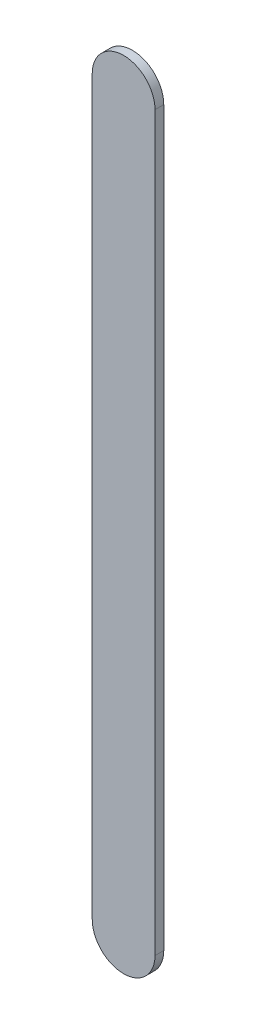
ISO-10303-21;
HEADER;
FILE_DESCRIPTION(('STEP AP214'),'2;1');
FILE_NAME('part.step','',(''),(''),'','','');
FILE_SCHEMA(('AUTOMOTIVE_DESIGN { 1 0 10303 214 1 1 1 1 }'));
ENDSEC;
DATA;
#1=APPLICATION_CONTEXT('core data for automotive mechanical design processes');
#2=APPLICATION_PROTOCOL_DEFINITION('international standard','automotive_design',2000,#1);
#3=PRODUCT_CONTEXT('',#1,'mechanical');
#4=PRODUCT('Part','Part','',(#3));
#5=PRODUCT_RELATED_PRODUCT_CATEGORY('part','',(#4));
#6=PRODUCT_DEFINITION_FORMATION('','',#4);
#7=PRODUCT_DEFINITION_CONTEXT('part definition',#1,'design');
#8=PRODUCT_DEFINITION('design','',#6,#7);
#9=PRODUCT_DEFINITION_SHAPE('','',#8);
#10=(LENGTH_UNIT() NAMED_UNIT(*) SI_UNIT(.MILLI.,.METRE.));
#11=(NAMED_UNIT(*) PLANE_ANGLE_UNIT() SI_UNIT($,.RADIAN.));
#12=(NAMED_UNIT(*) SI_UNIT($,.STERADIAN.) SOLID_ANGLE_UNIT());
#13=UNCERTAINTY_MEASURE_WITH_UNIT(LENGTH_MEASURE(1.E-05),#10,'distance_accuracy_value','');
#14=(GEOMETRIC_REPRESENTATION_CONTEXT(3) GLOBAL_UNCERTAINTY_ASSIGNED_CONTEXT((#13)) GLOBAL_UNIT_ASSIGNED_CONTEXT((#10,
#11,#12)) REPRESENTATION_CONTEXT('',''));
#15=CARTESIAN_POINT('',(0.,0.,0.));
#16=DIRECTION('',(0.,0.,1.));
#17=DIRECTION('',(1.,0.,0.));
#18=AXIS2_PLACEMENT_3D('',#15,#16,#17);
#19=CARTESIAN_POINT('',(92.16898,72.61197822,0.));
#20=DIRECTION('',(-1.,0.,0.));
#21=DIRECTION('',(0.,1.,0.));
#22=AXIS2_PLACEMENT_3D('',#19,#20,#21);
#23=PLANE('',#22);
#24=DIRECTION('',(0.,1.,0.));
#25=VECTOR('',#24,1.);
#26=CARTESIAN_POINT('',(92.16898,72.61197822,0.03556));
#27=LINE('',#26,#25);
#28=CARTESIAN_POINT('',(92.16898,72.61197822,0.03556));
#29=VERTEX_POINT('',#28);
#30=CARTESIAN_POINT('',(92.16898,75.5780048,0.03556));
#31=VERTEX_POINT('',#30);
#32=EDGE_CURVE('E11',#29,#31,#27,.T.);
#33=ORIENTED_EDGE('',*,*,#32,.F.);
#34=DIRECTION('',(0.,0.,1.));
#35=VECTOR('',#34,1.);
#36=CARTESIAN_POINT('',(92.16898,72.61197822,0.));
#37=LINE('',#36,#35);
#38=CARTESIAN_POINT('',(92.16898,72.61197822,0.));
#39=VERTEX_POINT('',#38);
#40=EDGE_CURVE('E24',#39,#29,#37,.T.);
#41=ORIENTED_EDGE('',*,*,#40,.F.);
#42=DIRECTION('',(0.,1.,0.));
#43=VECTOR('',#42,1.);
#44=CARTESIAN_POINT('',(92.16898,72.61197822,0.));
#45=LINE('',#44,#43);
#46=CARTESIAN_POINT('',(92.16898,75.5780048,0.));
#47=VERTEX_POINT('',#46);
#48=EDGE_CURVE('E75',#39,#47,#45,.T.);
#49=ORIENTED_EDGE('',*,*,#48,.T.);
#50=DIRECTION('',(0.,0.,1.));
#51=VECTOR('',#50,1.);
#52=CARTESIAN_POINT('',(92.16898,75.5780048,0.));
#53=LINE('',#52,#51);
#54=EDGE_CURVE('E37',#47,#31,#53,.T.);
#55=ORIENTED_EDGE('',*,*,#54,.T.);
#56=EDGE_LOOP('',(#33,#41,#49,#55));
#57=FACE_BOUND('',#56,.T.);
#58=ADVANCED_FACE('F17',(#57),#23,.F.);
#59=CARTESIAN_POINT('',(92.04198,75.5780048,0.));
#60=DIRECTION('',(0.,0.,-1.));
#61=DIRECTION('',(1.,0.,0.));
#62=AXIS2_PLACEMENT_3D('',#59,#60,#61);
#63=CYLINDRICAL_SURFACE('',#62,0.126999999999995);
#64=CARTESIAN_POINT('',(92.04198,75.5780048,0.03556));
#65=DIRECTION('',(0.,0.,1.));
#66=DIRECTION('',(1.,0.,0.));
#67=AXIS2_PLACEMENT_3D('',#64,#65,#66);
#68=CIRCLE('',#67,0.126999999999995);
#69=CARTESIAN_POINT('',(91.91498,75.5780048,0.03556));
#70=VERTEX_POINT('',#69);
#71=EDGE_CURVE('E83',#31,#70,#68,.T.);
#72=ORIENTED_EDGE('',*,*,#71,.F.);
#73=ORIENTED_EDGE('',*,*,#54,.F.);
#74=CARTESIAN_POINT('',(92.04198,75.5780048,0.));
#75=DIRECTION('',(0.,0.,1.));
#76=DIRECTION('',(1.,0.,0.));
#77=AXIS2_PLACEMENT_3D('',#74,#75,#76);
#78=CIRCLE('',#77,0.126999999999995);
#79=CARTESIAN_POINT('',(91.91498,75.5780048,0.));
#80=VERTEX_POINT('',#79);
#81=EDGE_CURVE('E81',#47,#80,#78,.T.);
#82=ORIENTED_EDGE('',*,*,#81,.T.);
#83=DIRECTION('',(0.,0.,1.));
#84=VECTOR('',#83,1.);
#85=CARTESIAN_POINT('',(91.91498,75.5780048,0.));
#86=LINE('',#85,#84);
#87=EDGE_CURVE('E67',#80,#70,#86,.T.);
#88=ORIENTED_EDGE('',*,*,#87,.T.);
#89=EDGE_LOOP('',(#72,#73,#82,#88));
#90=FACE_BOUND('',#89,.T.);
#91=ADVANCED_FACE('F89',(#90),#63,.T.);
#92=CARTESIAN_POINT('',(91.91498,75.5780048,0.));
#93=DIRECTION('',(1.,0.,0.));
#94=DIRECTION('',(0.,-1.,0.));
#95=AXIS2_PLACEMENT_3D('',#92,#93,#94);
#96=PLANE('',#95);
#97=DIRECTION('',(0.,-1.,0.));
#98=VECTOR('',#97,1.);
#99=CARTESIAN_POINT('',(91.91498,75.5780048,0.03556));
#100=LINE('',#99,#98);
#101=CARTESIAN_POINT('',(91.91498,72.61197822,0.03556));
#102=VERTEX_POINT('',#101);
#103=EDGE_CURVE('E71',#70,#102,#100,.T.);
#104=ORIENTED_EDGE('',*,*,#103,.F.);
#105=ORIENTED_EDGE('',*,*,#87,.F.);
#106=DIRECTION('',(0.,-1.,0.));
#107=VECTOR('',#106,1.);
#108=CARTESIAN_POINT('',(91.91498,75.5780048,0.));
#109=LINE('',#108,#107);
#110=CARTESIAN_POINT('',(91.91498,72.61197822,0.));
#111=VERTEX_POINT('',#110);
#112=EDGE_CURVE('E63',#80,#111,#109,.T.);
#113=ORIENTED_EDGE('',*,*,#112,.T.);
#114=DIRECTION('',(0.,0.,1.));
#115=VECTOR('',#114,1.);
#116=CARTESIAN_POINT('',(91.91498,72.61197822,0.));
#117=LINE('',#116,#115);
#118=EDGE_CURVE('E53',#111,#102,#117,.T.);
#119=ORIENTED_EDGE('',*,*,#118,.T.);
#120=EDGE_LOOP('',(#104,#105,#113,#119));
#121=FACE_BOUND('',#120,.T.);
#122=ADVANCED_FACE('F66',(#121),#96,.F.);
#123=CARTESIAN_POINT('',(92.04198,72.61197822,0.));
#124=DIRECTION('',(0.,0.,-1.));
#125=DIRECTION('',(-1.,0.,0.));
#126=AXIS2_PLACEMENT_3D('',#123,#124,#125);
#127=CYLINDRICAL_SURFACE('',#126,0.126999999999995);
#128=CARTESIAN_POINT('',(92.04198,72.61197822,0.03556));
#129=DIRECTION('',(0.,0.,1.));
#130=DIRECTION('',(-1.,0.,0.));
#131=AXIS2_PLACEMENT_3D('',#128,#129,#130);
#132=CIRCLE('',#131,0.126999999999995);
#133=EDGE_CURVE('E59',#102,#29,#132,.T.);
#134=ORIENTED_EDGE('',*,*,#133,.F.);
#135=ORIENTED_EDGE('',*,*,#118,.F.);
#136=CARTESIAN_POINT('',(92.04198,72.61197822,0.));
#137=DIRECTION('',(0.,0.,1.));
#138=DIRECTION('',(-1.,0.,0.));
#139=AXIS2_PLACEMENT_3D('',#136,#137,#138);
#140=CIRCLE('',#139,0.126999999999995);
#141=EDGE_CURVE('E57',#111,#39,#140,.T.);
#142=ORIENTED_EDGE('',*,*,#141,.T.);
#143=ORIENTED_EDGE('',*,*,#40,.T.);
#144=EDGE_LOOP('',(#134,#135,#142,#143));
#145=FACE_BOUND('',#144,.T.);
#146=ADVANCED_FACE('F55',(#145),#127,.T.);
#147=CARTESIAN_POINT('',(92.16898,72.61197822,0.));
#148=DIRECTION('',(0.,0.,-1.));
#149=DIRECTION('',(-1.,0.,0.));
#150=AXIS2_PLACEMENT_3D('',#147,#148,#149);
#151=PLANE('',#150);
#152=ORIENTED_EDGE('',*,*,#141,.F.);
#153=ORIENTED_EDGE('',*,*,#112,.F.);
#154=ORIENTED_EDGE('',*,*,#81,.F.);
#155=ORIENTED_EDGE('',*,*,#48,.F.);
#156=EDGE_LOOP('',(#152,#153,#154,#155));
#157=FACE_BOUND('',#156,.T.);
#158=ADVANCED_FACE('F74',(#157),#151,.T.);
#159=CARTESIAN_POINT('',(92.16898,72.61197822,0.03556));
#160=DIRECTION('',(0.,0.,-1.));
#161=DIRECTION('',(-1.,0.,0.));
#162=AXIS2_PLACEMENT_3D('',#159,#160,#161);
#163=PLANE('',#162);
#164=ORIENTED_EDGE('',*,*,#32,.T.);
#165=ORIENTED_EDGE('',*,*,#71,.T.);
#166=ORIENTED_EDGE('',*,*,#103,.T.);
#167=ORIENTED_EDGE('',*,*,#133,.T.);
#168=EDGE_LOOP('',(#164,#165,#166,#167));
#169=FACE_BOUND('',#168,.T.);
#170=ADVANCED_FACE('F91',(#169),#163,.F.);
#171=CLOSED_SHELL('',(#58,#91,#122,#146,#158,#170));
#172=MANIFOLD_SOLID_BREP('B1',#171);
#173=ADVANCED_BREP_SHAPE_REPRESENTATION('',(#18,#172),#14);
#174=SHAPE_DEFINITION_REPRESENTATION(#9,#173);
ENDSEC;
END-ISO-10303-21;
